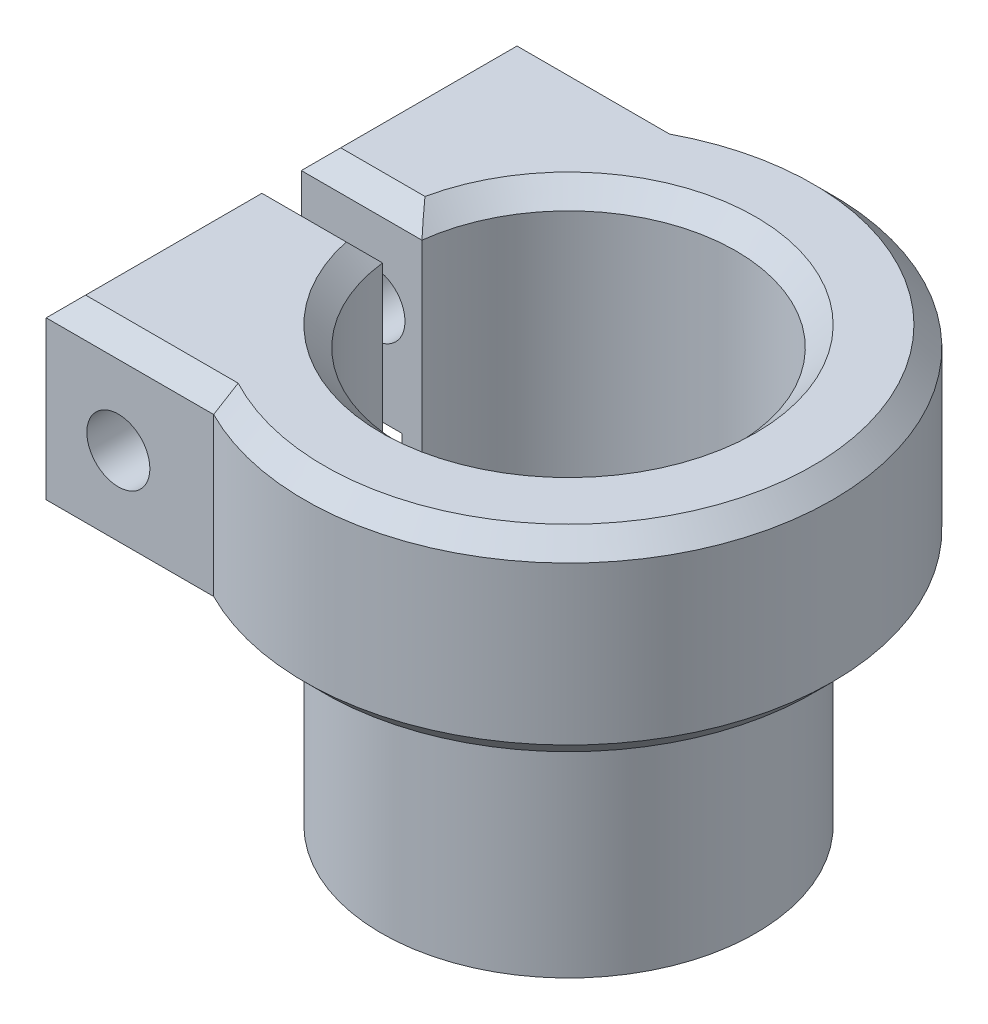
ISO-10303-21;
HEADER;
FILE_DESCRIPTION(('STEP AP214'),'2;1');
FILE_NAME('part.step','',(''),(''),'','','');
FILE_SCHEMA(('AUTOMOTIVE_DESIGN { 1 0 10303 214 1 1 1 1 }'));
ENDSEC;
DATA;
#1=APPLICATION_CONTEXT('core data for automotive mechanical design processes');
#2=APPLICATION_PROTOCOL_DEFINITION('international standard','automotive_design',2000,#1);
#3=PRODUCT_CONTEXT('',#1,'mechanical');
#4=PRODUCT('Part','Part','',(#3));
#5=PRODUCT_RELATED_PRODUCT_CATEGORY('part','',(#4));
#6=PRODUCT_DEFINITION_FORMATION('','',#4);
#7=PRODUCT_DEFINITION_CONTEXT('part definition',#1,'design');
#8=PRODUCT_DEFINITION('design','',#6,#7);
#9=PRODUCT_DEFINITION_SHAPE('','',#8);
#10=(LENGTH_UNIT() NAMED_UNIT(*) SI_UNIT(.MILLI.,.METRE.));
#11=(NAMED_UNIT(*) PLANE_ANGLE_UNIT() SI_UNIT($,.RADIAN.));
#12=(NAMED_UNIT(*) SI_UNIT($,.STERADIAN.) SOLID_ANGLE_UNIT());
#13=UNCERTAINTY_MEASURE_WITH_UNIT(LENGTH_MEASURE(1.E-05),#10,'distance_accuracy_value','');
#14=(GEOMETRIC_REPRESENTATION_CONTEXT(3) GLOBAL_UNCERTAINTY_ASSIGNED_CONTEXT((#13)) GLOBAL_UNIT_ASSIGNED_CONTEXT((#10,
#11,#12)) REPRESENTATION_CONTEXT('',''));
#15=CARTESIAN_POINT('',(0.,0.,0.));
#16=DIRECTION('',(0.,0.,1.));
#17=DIRECTION('',(1.,0.,0.));
#18=AXIS2_PLACEMENT_3D('',#15,#16,#17);
#19=CARTESIAN_POINT('',(0.,0.,0.));
#20=DIRECTION('',(0.,1.,0.));
#21=DIRECTION('',(0.,0.,1.));
#22=AXIS2_PLACEMENT_3D('',#19,#20,#21);
#23=PLANE('',#22);
#24=CARTESIAN_POINT('',(0.,0.,0.));
#25=DIRECTION('',(0.,1.,0.));
#26=DIRECTION('',(0.,0.,1.));
#27=AXIS2_PLACEMENT_3D('',#24,#25,#26);
#28=CIRCLE('',#27,9.5);
#29=CARTESIAN_POINT('',(-9.44722181384559,0.,1.));
#30=VERTEX_POINT('',#29);
#31=CARTESIAN_POINT('',(-9.44722181384559,0.,-1.));
#32=VERTEX_POINT('',#31);
#33=EDGE_CURVE('E185',#30,#32,#28,.T.);
#34=ORIENTED_EDGE('',*,*,#33,.F.);
#35=DIRECTION('',(1.,0.,0.));
#36=VECTOR('',#35,1.);
#37=CARTESIAN_POINT('',(-21.,0.,1.));
#38=LINE('',#37,#36);
#39=CARTESIAN_POINT('',(-8.44097150806707,0.,1.));
#40=VERTEX_POINT('',#39);
#41=EDGE_CURVE('E189',#30,#40,#38,.T.);
#42=ORIENTED_EDGE('',*,*,#41,.T.);
#43=CARTESIAN_POINT('',(0.,0.,0.));
#44=DIRECTION('',(0.,1.,0.));
#45=DIRECTION('',(0.,0.,1.));
#46=AXIS2_PLACEMENT_3D('',#43,#44,#45);
#47=CIRCLE('',#46,8.5);
#48=CARTESIAN_POINT('',(-8.44097150806707,0.,-1.));
#49=VERTEX_POINT('',#48);
#50=EDGE_CURVE('E187',#40,#49,#47,.T.);
#51=ORIENTED_EDGE('',*,*,#50,.T.);
#52=DIRECTION('',(1.,0.,0.));
#53=VECTOR('',#52,1.);
#54=CARTESIAN_POINT('',(-21.,0.,-1.));
#55=LINE('',#54,#53);
#56=EDGE_CURVE('E171',#32,#49,#55,.T.);
#57=ORIENTED_EDGE('',*,*,#56,.F.);
#58=EDGE_LOOP('',(#34,#42,#51,#57));
#59=FACE_BOUND('',#58,.T.);
#60=ADVANCED_FACE('F47',(#59),#23,.F.);
#61=CARTESIAN_POINT('',(0.,12.,0.));
#62=DIRECTION('',(0.,-1.,0.));
#63=DIRECTION('',(0.,0.,-1.));
#64=AXIS2_PLACEMENT_3D('',#61,#62,#63);
#65=CYLINDRICAL_SURFACE('',#64,9.5);
#66=CARTESIAN_POINT('',(0.,12.,0.));
#67=DIRECTION('',(0.,1.,0.));
#68=DIRECTION('',(0.,0.,1.));
#69=AXIS2_PLACEMENT_3D('',#66,#67,#68);
#70=CIRCLE('',#69,9.5);
#71=CARTESIAN_POINT('',(-9.44722181384559,12.,0.999999999999999));
#72=VERTEX_POINT('',#71);
#73=CARTESIAN_POINT('',(-9.44722181384559,12.,-0.999999999999999));
#74=VERTEX_POINT('',#73);
#75=EDGE_CURVE('E196',#72,#74,#70,.T.);
#76=ORIENTED_EDGE('',*,*,#75,.F.);
#77=DIRECTION('',(0.,-1.,0.));
#78=VECTOR('',#77,1.);
#79=CARTESIAN_POINT('',(-9.44722181384559,12.,0.999999999999999));
#80=LINE('',#79,#78);
#81=EDGE_CURVE('E194',#72,#30,#80,.T.);
#82=ORIENTED_EDGE('',*,*,#81,.T.);
#83=ORIENTED_EDGE('',*,*,#33,.T.);
#84=DIRECTION('',(0.,-1.,0.));
#85=VECTOR('',#84,1.);
#86=CARTESIAN_POINT('',(-9.44722181384559,12.,-0.999999999999999));
#87=LINE('',#86,#85);
#88=EDGE_CURVE('E167',#32,#74,#87,.F.);
#89=ORIENTED_EDGE('',*,*,#88,.T.);
#90=EDGE_LOOP('',(#76,#82,#83,#89));
#91=FACE_BOUND('',#90,.T.);
#92=ADVANCED_FACE('F192',(#91),#65,.T.);
#93=CARTESIAN_POINT('',(0.,12.,0.));
#94=DIRECTION('',(0.,-1.,0.));
#95=DIRECTION('',(0.,0.,-1.));
#96=AXIS2_PLACEMENT_3D('',#93,#94,#95);
#97=CYLINDRICAL_SURFACE('',#96,8.5);
#98=DIRECTION('',(0.,-1.,0.));
#99=VECTOR('',#98,1.);
#100=CARTESIAN_POINT('',(-8.44097150806707,12.,0.999999999999999));
#101=LINE('',#100,#99);
#102=CARTESIAN_POINT('',(-8.44097150806707,21.,0.999999999999999));
#103=VERTEX_POINT('',#102);
#104=EDGE_CURVE('E202',#103,#40,#101,.T.);
#105=ORIENTED_EDGE('',*,*,#104,.F.);
#106=CARTESIAN_POINT('',(0.,21.,0.));
#107=DIRECTION('',(0.,1.,0.));
#108=DIRECTION('',(0.,0.,1.));
#109=AXIS2_PLACEMENT_3D('',#106,#107,#108);
#110=CIRCLE('',#109,8.5);
#111=CARTESIAN_POINT('',(-8.44097150806707,21.,-0.999999999999999));
#112=VERTEX_POINT('',#111);
#113=EDGE_CURVE('E254',#103,#112,#110,.T.);
#114=ORIENTED_EDGE('',*,*,#113,.T.);
#115=DIRECTION('',(0.,-1.,0.));
#116=VECTOR('',#115,1.);
#117=CARTESIAN_POINT('',(-8.44097150806707,12.,-0.999999999999999));
#118=LINE('',#117,#116);
#119=EDGE_CURVE('E179',#49,#112,#118,.F.);
#120=ORIENTED_EDGE('',*,*,#119,.F.);
#121=ORIENTED_EDGE('',*,*,#50,.F.);
#122=EDGE_LOOP('',(#105,#114,#120,#121));
#123=FACE_BOUND('',#122,.T.);
#124=ADVANCED_FACE('F431',(#123),#97,.F.);
#125=CARTESIAN_POINT('',(0.,22.,0.));
#126=DIRECTION('',(0.,1.,0.));
#127=DIRECTION('',(0.,0.,1.));
#128=AXIS2_PLACEMENT_3D('',#125,#126,#127);
#129=PLANE('',#128);
#130=DIRECTION('',(0.,0.,1.));
#131=VECTOR('',#130,1.);
#132=CARTESIAN_POINT('',(-13.5637208057857,22.,0.));
#133=LINE('',#132,#131);
#134=CARTESIAN_POINT('',(-13.5637208057857,22.,2.));
#135=VERTEX_POINT('',#134);
#136=CARTESIAN_POINT('',(-13.5637208057857,22.,10.9495309526978));
#137=VERTEX_POINT('',#136);
#138=EDGE_CURVE('E228',#135,#137,#133,.T.);
#139=ORIENTED_EDGE('',*,*,#138,.T.);
#140=DIRECTION('',(1.,0.,0.));
#141=VECTOR('',#140,1.);
#142=CARTESIAN_POINT('',(0.,22.,10.9495309526978));
#143=LINE('',#142,#141);
#144=CARTESIAN_POINT('',(-5.81960238469219,22.,10.9495309526977));
#145=VERTEX_POINT('',#144);
#146=EDGE_CURVE('E231',#137,#145,#143,.T.);
#147=ORIENTED_EDGE('',*,*,#146,.T.);
#148=CARTESIAN_POINT('',(0.,22.,0.));
#149=DIRECTION('',(0.,1.,0.));
#150=DIRECTION('',(0.,0.,1.));
#151=AXIS2_PLACEMENT_3D('',#148,#149,#150);
#152=CIRCLE('',#151,12.4);
#153=CARTESIAN_POINT('',(-5.81960238469219,22.,-10.9495309526977));
#154=VERTEX_POINT('',#153);
#155=EDGE_CURVE('E200',#145,#154,#152,.T.);
#156=ORIENTED_EDGE('',*,*,#155,.T.);
#157=DIRECTION('',(-1.,0.,0.));
#158=VECTOR('',#157,1.);
#159=CARTESIAN_POINT('',(0.,22.,-10.9495309526978));
#160=LINE('',#159,#158);
#161=CARTESIAN_POINT('',(-13.5637208057857,22.,-10.9495309526978));
#162=VERTEX_POINT('',#161);
#163=EDGE_CURVE('E213',#154,#162,#160,.T.);
#164=ORIENTED_EDGE('',*,*,#163,.T.);
#165=DIRECTION('',(0.,0.,1.));
#166=VECTOR('',#165,1.);
#167=CARTESIAN_POINT('',(-13.5637208057857,22.,0.));
#168=LINE('',#167,#166);
#169=CARTESIAN_POINT('',(-13.5637208057857,22.,-2.));
#170=VERTEX_POINT('',#169);
#171=EDGE_CURVE('E216',#162,#170,#168,.T.);
#172=ORIENTED_EDGE('',*,*,#171,.T.);
#173=DIRECTION('',(1.,0.,0.));
#174=VECTOR('',#173,1.);
#175=CARTESIAN_POINT('',(-8.44097150806707,22.,-2.));
#176=LINE('',#175,#174);
#177=CARTESIAN_POINT('',(-9.28708781050336,22.,-2.));
#178=VERTEX_POINT('',#177);
#179=EDGE_CURVE('E219',#170,#178,#176,.T.);
#180=ORIENTED_EDGE('',*,*,#179,.T.);
#181=CARTESIAN_POINT('',(0.,22.,0.));
#182=DIRECTION('',(0.,1.,0.));
#183=DIRECTION('',(0.,0.,1.));
#184=AXIS2_PLACEMENT_3D('',#181,#182,#183);
#185=CIRCLE('',#184,9.50000000000001);
#186=CARTESIAN_POINT('',(-9.28708781050336,22.,1.99999999999999));
#187=VERTEX_POINT('',#186);
#188=EDGE_CURVE('E222',#178,#187,#185,.F.);
#189=ORIENTED_EDGE('',*,*,#188,.T.);
#190=DIRECTION('',(-1.,0.,0.));
#191=VECTOR('',#190,1.);
#192=CARTESIAN_POINT('',(-14.5637208057857,22.,2.));
#193=LINE('',#192,#191);
#194=EDGE_CURVE('E225',#187,#135,#193,.T.);
#195=ORIENTED_EDGE('',*,*,#194,.T.);
#196=EDGE_LOOP('',(#139,#147,#156,#164,#172,#180,#189,#195));
#197=FACE_BOUND('',#196,.T.);
#198=ADVANCED_FACE('F435',(#197),#129,.T.);
#199=CARTESIAN_POINT('',(0.,12.,0.));
#200=DIRECTION('',(0.,1.,0.));
#201=DIRECTION('',(0.,0.,1.));
#202=AXIS2_PLACEMENT_3D('',#199,#200,#201);
#203=PLANE('',#202);
#204=DIRECTION('',(-1.,0.,0.));
#205=VECTOR('',#204,1.);
#206=CARTESIAN_POINT('',(0.,12.,-0.999999999999999));
#207=LINE('',#206,#205);
#208=CARTESIAN_POINT('',(-13.5637208057857,12.,-0.999999999999999));
#209=VERTEX_POINT('',#208);
#210=EDGE_CURVE('E174',#74,#209,#207,.T.);
#211=ORIENTED_EDGE('',*,*,#210,.T.);
#212=DIRECTION('',(0.,0.,-1.));
#213=VECTOR('',#212,1.);
#214=CARTESIAN_POINT('',(-13.5637208057857,12.,-11.9495309526978));
#215=LINE('',#214,#213);
#216=CARTESIAN_POINT('',(-13.5637208057857,12.,-10.9495309526978));
#217=VERTEX_POINT('',#216);
#218=EDGE_CURVE('E11',#209,#217,#215,.T.);
#219=ORIENTED_EDGE('',*,*,#218,.T.);
#220=DIRECTION('',(1.,0.,0.));
#221=VECTOR('',#220,1.);
#222=CARTESIAN_POINT('',(-6.06372080578567,12.,-10.9495309526978));
#223=LINE('',#222,#221);
#224=CARTESIAN_POINT('',(-5.8196023846922,12.,-10.9495309526978));
#225=VERTEX_POINT('',#224);
#226=EDGE_CURVE('E282',#217,#225,#223,.T.);
#227=ORIENTED_EDGE('',*,*,#226,.T.);
#228=CARTESIAN_POINT('',(0.,12.,0.));
#229=DIRECTION('',(0.,1.,0.));
#230=DIRECTION('',(0.,0.,1.));
#231=AXIS2_PLACEMENT_3D('',#228,#229,#230);
#232=CIRCLE('',#231,12.4);
#233=CARTESIAN_POINT('',(-5.8196023846922,12.,10.9495309526977));
#234=VERTEX_POINT('',#233);
#235=EDGE_CURVE('E71',#225,#234,#232,.F.);
#236=ORIENTED_EDGE('',*,*,#235,.T.);
#237=DIRECTION('',(-1.,0.,0.));
#238=VECTOR('',#237,1.);
#239=CARTESIAN_POINT('',(-14.5637208057857,12.,10.9495309526978));
#240=LINE('',#239,#238);
#241=CARTESIAN_POINT('',(-13.5637208057857,12.,10.9495309526978));
#242=VERTEX_POINT('',#241);
#243=EDGE_CURVE('E66',#234,#242,#240,.T.);
#244=ORIENTED_EDGE('',*,*,#243,.T.);
#245=DIRECTION('',(0.,0.,-1.));
#246=VECTOR('',#245,1.);
#247=CARTESIAN_POINT('',(-13.5637208057857,12.,0.999999999999997));
#248=LINE('',#247,#246);
#249=CARTESIAN_POINT('',(-13.5637208057857,12.,0.999999999999999));
#250=VERTEX_POINT('',#249);
#251=EDGE_CURVE('E58',#242,#250,#248,.T.);
#252=ORIENTED_EDGE('',*,*,#251,.T.);
#253=DIRECTION('',(1.,0.,0.));
#254=VECTOR('',#253,1.);
#255=CARTESIAN_POINT('',(0.,12.,0.999999999999999));
#256=LINE('',#255,#254);
#257=EDGE_CURVE('E520',#250,#72,#256,.T.);
#258=ORIENTED_EDGE('',*,*,#257,.T.);
#259=ORIENTED_EDGE('',*,*,#75,.T.);
#260=EDGE_LOOP('',(#211,#219,#227,#236,#244,#252,#258,#259));
#261=FACE_BOUND('',#260,.T.);
#262=ADVANCED_FACE('F440',(#261),#203,.F.);
#263=CARTESIAN_POINT('',(0.,22.,0.));
#264=DIRECTION('',(0.,-1.,0.));
#265=DIRECTION('',(0.,0.,-1.));
#266=AXIS2_PLACEMENT_3D('',#263,#264,#265);
#267=CYLINDRICAL_SURFACE('',#266,13.4);
#268=DIRECTION('',(0.,1.,0.));
#269=VECTOR('',#268,1.);
#270=CARTESIAN_POINT('',(-6.06372080578567,12.,-11.9495309526978));
#271=LINE('',#270,#269);
#272=CARTESIAN_POINT('',(-6.06372080578567,13.,-11.9495309526978));
#273=VERTEX_POINT('',#272);
#274=CARTESIAN_POINT('',(-6.06372080578567,21.,-11.9495309526978));
#275=VERTEX_POINT('',#274);
#276=EDGE_CURVE('E495',#273,#275,#271,.T.);
#277=ORIENTED_EDGE('',*,*,#276,.T.);
#278=CARTESIAN_POINT('',(0.,21.,0.));
#279=DIRECTION('',(0.,1.,0.));
#280=DIRECTION('',(0.,0.,1.));
#281=AXIS2_PLACEMENT_3D('',#278,#279,#280);
#282=CIRCLE('',#281,13.4);
#283=CARTESIAN_POINT('',(-6.06372080578567,21.,11.9495309526978));
#284=VERTEX_POINT('',#283);
#285=EDGE_CURVE('E279',#275,#284,#282,.F.);
#286=ORIENTED_EDGE('',*,*,#285,.T.);
#287=DIRECTION('',(0.,1.,0.));
#288=VECTOR('',#287,1.);
#289=CARTESIAN_POINT('',(-6.06372080578567,12.,11.9495309526978));
#290=LINE('',#289,#288);
#291=CARTESIAN_POINT('',(-6.06372080578567,13.,11.9495309526978));
#292=VERTEX_POINT('',#291);
#293=EDGE_CURVE('E503',#292,#284,#290,.T.);
#294=ORIENTED_EDGE('',*,*,#293,.F.);
#295=CARTESIAN_POINT('',(0.,13.,0.));
#296=DIRECTION('',(0.,1.,0.));
#297=DIRECTION('',(0.,0.,1.));
#298=AXIS2_PLACEMENT_3D('',#295,#296,#297);
#299=CIRCLE('',#298,13.4);
#300=EDGE_CURVE('E276',#292,#273,#299,.T.);
#301=ORIENTED_EDGE('',*,*,#300,.T.);
#302=EDGE_LOOP('',(#277,#286,#294,#301));
#303=FACE_BOUND('',#302,.T.);
#304=ADVANCED_FACE('F437',(#303),#267,.T.);
#305=CARTESIAN_POINT('',(-21.,22.,-0.999999999999997));
#306=DIRECTION('',(0.,0.,-1.));
#307=DIRECTION('',(0.,1.,0.));
#308=AXIS2_PLACEMENT_3D('',#305,#306,#307);
#309=PLANE('',#308);
#310=CARTESIAN_POINT('',(-10.9018029894296,17.,-0.999999999999997));
#311=DIRECTION('',(0.,0.,-1.));
#312=DIRECTION('',(0.,1.,0.));
#313=AXIS2_PLACEMENT_3D('',#310,#311,#312);
#314=CIRCLE('',#313,1.6);
#315=CARTESIAN_POINT('',(-10.9018029894296,18.6,-0.999999999999997));
#316=VERTEX_POINT('',#315);
#317=EDGE_CURVE('E481',#316,#316,#314,.F.);
#318=ORIENTED_EDGE('',*,*,#317,.F.);
#319=EDGE_LOOP('',(#318));
#320=FACE_BOUND('',#319,.T.);
#321=ORIENTED_EDGE('',*,*,#119,.T.);
#322=DIRECTION('',(-1.,0.,0.));
#323=VECTOR('',#322,1.);
#324=CARTESIAN_POINT('',(-14.5637208057857,21.,-0.999999999999998));
#325=LINE('',#324,#323);
#326=CARTESIAN_POINT('',(-14.5637208057857,21.,-0.999999999999997));
#327=VERTEX_POINT('',#326);
#328=EDGE_CURVE('E260',#112,#327,#325,.T.);
#329=ORIENTED_EDGE('',*,*,#328,.T.);
#330=DIRECTION('',(0.,1.,0.));
#331=VECTOR('',#330,1.);
#332=CARTESIAN_POINT('',(-14.5637208057857,12.,-0.999999999999997));
#333=LINE('',#332,#331);
#334=CARTESIAN_POINT('',(-14.5637208057857,13.,-0.999999999999997));
#335=VERTEX_POINT('',#334);
#336=EDGE_CURVE('E483',#335,#327,#333,.T.);
#337=ORIENTED_EDGE('',*,*,#336,.F.);
#338=DIRECTION('',(0.707106781186548,-0.707106781186548,0.));
#339=VECTOR('',#338,1.);
#340=CARTESIAN_POINT('',(-14.5637208057857,13.,-0.999999999999999));
#341=LINE('',#340,#339);
#342=EDGE_CURVE('E257',#335,#209,#341,.T.);
#343=ORIENTED_EDGE('',*,*,#342,.T.);
#344=ORIENTED_EDGE('',*,*,#210,.F.);
#345=ORIENTED_EDGE('',*,*,#88,.F.);
#346=ORIENTED_EDGE('',*,*,#56,.T.);
#347=EDGE_LOOP('',(#321,#329,#337,#343,#344,#345,#346));
#348=FACE_BOUND('',#347,.T.);
#349=ADVANCED_FACE('F170',(#320,#348),#309,.F.);
#350=CARTESIAN_POINT('',(-21.,22.,0.999999999999997));
#351=DIRECTION('',(0.,0.,1.));
#352=DIRECTION('',(0.,-1.,0.));
#353=AXIS2_PLACEMENT_3D('',#350,#351,#352);
#354=PLANE('',#353);
#355=CARTESIAN_POINT('',(-10.9018029894296,17.,0.999999999999997));
#356=DIRECTION('',(0.,0.,1.));
#357=DIRECTION('',(0.,-1.,0.));
#358=AXIS2_PLACEMENT_3D('',#355,#356,#357);
#359=CIRCLE('',#358,1.6);
#360=CARTESIAN_POINT('',(-10.9018029894296,15.4,0.999999999999998));
#361=VERTEX_POINT('',#360);
#362=EDGE_CURVE('E484',#361,#361,#359,.F.);
#363=ORIENTED_EDGE('',*,*,#362,.F.);
#364=EDGE_LOOP('',(#363));
#365=FACE_BOUND('',#364,.T.);
#366=DIRECTION('',(0.,1.,0.));
#367=VECTOR('',#366,1.);
#368=CARTESIAN_POINT('',(-14.5637208057857,12.,0.999999999999997));
#369=LINE('',#368,#367);
#370=CARTESIAN_POINT('',(-14.5637208057857,13.,0.999999999999997));
#371=VERTEX_POINT('',#370);
#372=CARTESIAN_POINT('',(-14.5637208057857,21.,0.999999999999997));
#373=VERTEX_POINT('',#372);
#374=EDGE_CURVE('E499',#371,#373,#369,.T.);
#375=ORIENTED_EDGE('',*,*,#374,.T.);
#376=DIRECTION('',(1.,0.,0.));
#377=VECTOR('',#376,1.);
#378=CARTESIAN_POINT('',(-8.44097150806707,21.,0.999999999999998));
#379=LINE('',#378,#377);
#380=EDGE_CURVE('E251',#373,#103,#379,.T.);
#381=ORIENTED_EDGE('',*,*,#380,.T.);
#382=ORIENTED_EDGE('',*,*,#104,.T.);
#383=ORIENTED_EDGE('',*,*,#41,.F.);
#384=ORIENTED_EDGE('',*,*,#81,.F.);
#385=ORIENTED_EDGE('',*,*,#257,.F.);
#386=DIRECTION('',(-0.707106781186548,0.707106781186548,0.));
#387=VECTOR('',#386,1.);
#388=CARTESIAN_POINT('',(-14.5637208057857,13.,0.999999999999999));
#389=LINE('',#388,#387);
#390=EDGE_CURVE('E248',#250,#371,#389,.T.);
#391=ORIENTED_EDGE('',*,*,#390,.T.);
#392=EDGE_LOOP('',(#375,#381,#382,#383,#384,#385,#391));
#393=FACE_BOUND('',#392,.T.);
#394=ADVANCED_FACE('F447',(#365,#393),#354,.F.);
#395=CARTESIAN_POINT('',(-6.06372080578567,12.,11.9495309526978));
#396=DIRECTION('',(0.,0.,1.));
#397=DIRECTION('',(1.,0.,0.));
#398=AXIS2_PLACEMENT_3D('',#395,#396,#397);
#399=PLANE('',#398);
#400=CARTESIAN_POINT('',(-10.9018029894296,17.,11.9495309526978));
#401=DIRECTION('',(0.,0.,1.));
#402=DIRECTION('',(1.,0.,0.));
#403=AXIS2_PLACEMENT_3D('',#400,#401,#402);
#404=CIRCLE('',#403,1.6);
#405=CARTESIAN_POINT('',(-9.30180298942956,17.,11.9495309526978));
#406=VERTEX_POINT('',#405);
#407=EDGE_CURVE('E209',#406,#406,#404,.F.);
#408=ORIENTED_EDGE('',*,*,#407,.T.);
#409=EDGE_LOOP('',(#408));
#410=FACE_BOUND('',#409,.T.);
#411=ORIENTED_EDGE('',*,*,#293,.T.);
#412=DIRECTION('',(-1.,0.,0.));
#413=VECTOR('',#412,1.);
#414=CARTESIAN_POINT('',(-6.06372080578567,21.,11.9495309526978));
#415=LINE('',#414,#413);
#416=CARTESIAN_POINT('',(-14.5637208057857,21.,11.9495309526978));
#417=VERTEX_POINT('',#416);
#418=EDGE_CURVE('E238',#284,#417,#415,.T.);
#419=ORIENTED_EDGE('',*,*,#418,.T.);
#420=DIRECTION('',(0.,1.,0.));
#421=VECTOR('',#420,1.);
#422=CARTESIAN_POINT('',(-14.5637208057857,12.,11.9495309526978));
#423=LINE('',#422,#421);
#424=CARTESIAN_POINT('',(-14.5637208057857,13.,11.9495309526978));
#425=VERTEX_POINT('',#424);
#426=EDGE_CURVE('E507',#425,#417,#423,.T.);
#427=ORIENTED_EDGE('',*,*,#426,.F.);
#428=DIRECTION('',(1.,0.,0.));
#429=VECTOR('',#428,1.);
#430=CARTESIAN_POINT('',(-6.06372080578567,13.,11.9495309526978));
#431=LINE('',#430,#429);
#432=EDGE_CURVE('E235',#425,#292,#431,.T.);
#433=ORIENTED_EDGE('',*,*,#432,.T.);
#434=EDGE_LOOP('',(#411,#419,#427,#433));
#435=FACE_BOUND('',#434,.T.);
#436=ADVANCED_FACE('F450',(#410,#435),#399,.T.);
#437=CARTESIAN_POINT('',(-14.5637208057857,12.,0.999999999999997));
#438=DIRECTION('',(-1.,0.,0.));
#439=DIRECTION('',(0.,0.,1.));
#440=AXIS2_PLACEMENT_3D('',#437,#438,#439);
#441=PLANE('',#440);
#442=ORIENTED_EDGE('',*,*,#426,.T.);
#443=DIRECTION('',(0.,0.,-1.));
#444=VECTOR('',#443,1.);
#445=CARTESIAN_POINT('',(-14.5637208057857,21.,0.999999999999997));
#446=LINE('',#445,#444);
#447=EDGE_CURVE('E245',#417,#373,#446,.T.);
#448=ORIENTED_EDGE('',*,*,#447,.T.);
#449=ORIENTED_EDGE('',*,*,#374,.F.);
#450=DIRECTION('',(0.,0.,1.));
#451=VECTOR('',#450,1.);
#452=CARTESIAN_POINT('',(-14.5637208057857,13.,11.9495309526978));
#453=LINE('',#452,#451);
#454=EDGE_CURVE('E242',#371,#425,#453,.T.);
#455=ORIENTED_EDGE('',*,*,#454,.T.);
#456=EDGE_LOOP('',(#442,#448,#449,#455));
#457=FACE_BOUND('',#456,.T.);
#458=ADVANCED_FACE('F455',(#457),#441,.T.);
#459=CARTESIAN_POINT('',(-14.5637208057857,12.,-0.999999999999997));
#460=DIRECTION('',(-1.,0.,0.));
#461=DIRECTION('',(0.,0.,1.));
#462=AXIS2_PLACEMENT_3D('',#459,#460,#461);
#463=PLANE('',#462);
#464=ORIENTED_EDGE('',*,*,#336,.T.);
#465=DIRECTION('',(0.,0.,-1.));
#466=VECTOR('',#465,1.);
#467=CARTESIAN_POINT('',(-14.5637208057857,21.,-0.999999999999997));
#468=LINE('',#467,#466);
#469=CARTESIAN_POINT('',(-14.5637208057857,21.,-11.9495309526978));
#470=VERTEX_POINT('',#469);
#471=EDGE_CURVE('E267',#327,#470,#468,.T.);
#472=ORIENTED_EDGE('',*,*,#471,.T.);
#473=DIRECTION('',(0.,1.,0.));
#474=VECTOR('',#473,1.);
#475=CARTESIAN_POINT('',(-14.5637208057857,12.,-11.9495309526978));
#476=LINE('',#475,#474);
#477=CARTESIAN_POINT('',(-14.5637208057857,13.,-11.9495309526978));
#478=VERTEX_POINT('',#477);
#479=EDGE_CURVE('E489',#478,#470,#476,.T.);
#480=ORIENTED_EDGE('',*,*,#479,.F.);
#481=DIRECTION('',(0.,0.,1.));
#482=VECTOR('',#481,1.);
#483=CARTESIAN_POINT('',(-14.5637208057857,13.,-0.999999999999997));
#484=LINE('',#483,#482);
#485=EDGE_CURVE('E263',#478,#335,#484,.T.);
#486=ORIENTED_EDGE('',*,*,#485,.T.);
#487=EDGE_LOOP('',(#464,#472,#480,#486));
#488=FACE_BOUND('',#487,.T.);
#489=ADVANCED_FACE('F458',(#488),#463,.T.);
#490=CARTESIAN_POINT('',(-6.06372080578567,12.,-11.9495309526978));
#491=DIRECTION('',(0.,0.,-1.));
#492=DIRECTION('',(-1.,0.,0.));
#493=AXIS2_PLACEMENT_3D('',#490,#491,#492);
#494=PLANE('',#493);
#495=CARTESIAN_POINT('',(-10.9018029894296,17.,-11.9495309526978));
#496=DIRECTION('',(0.,0.,-1.));
#497=DIRECTION('',(-1.,0.,0.));
#498=AXIS2_PLACEMENT_3D('',#495,#496,#497);
#499=CIRCLE('',#498,1.6);
#500=CARTESIAN_POINT('',(-12.5018029894296,17.,-11.9495309526978));
#501=VERTEX_POINT('',#500);
#502=EDGE_CURVE('E205',#501,#501,#499,.F.);
#503=ORIENTED_EDGE('',*,*,#502,.T.);
#504=EDGE_LOOP('',(#503));
#505=FACE_BOUND('',#504,.T.);
#506=ORIENTED_EDGE('',*,*,#479,.T.);
#507=DIRECTION('',(1.,0.,0.));
#508=VECTOR('',#507,1.);
#509=CARTESIAN_POINT('',(-6.06372080578567,21.,-11.9495309526978));
#510=LINE('',#509,#508);
#511=EDGE_CURVE('E273',#470,#275,#510,.T.);
#512=ORIENTED_EDGE('',*,*,#511,.T.);
#513=ORIENTED_EDGE('',*,*,#276,.F.);
#514=DIRECTION('',(-1.,0.,0.));
#515=VECTOR('',#514,1.);
#516=CARTESIAN_POINT('',(-14.5637208057857,13.,-11.9495309526978));
#517=LINE('',#516,#515);
#518=EDGE_CURVE('E270',#273,#478,#517,.T.);
#519=ORIENTED_EDGE('',*,*,#518,.T.);
#520=EDGE_LOOP('',(#506,#512,#513,#519));
#521=FACE_BOUND('',#520,.T.);
#522=ADVANCED_FACE('F465',(#505,#521),#494,.T.);
#523=CARTESIAN_POINT('',(-10.9018029894296,17.,20.));
#524=DIRECTION('',(0.,0.,-1.));
#525=DIRECTION('',(-1.,0.,0.));
#526=AXIS2_PLACEMENT_3D('',#523,#524,#525);
#527=CYLINDRICAL_SURFACE('',#526,1.6);
#528=ORIENTED_EDGE('',*,*,#502,.F.);
#529=EDGE_LOOP('',(#528));
#530=FACE_BOUND('',#529,.T.);
#531=ORIENTED_EDGE('',*,*,#317,.T.);
#532=EDGE_LOOP('',(#531));
#533=FACE_BOUND('',#532,.T.);
#534=ADVANCED_FACE('F469',(#530,#533),#527,.F.);
#535=ORIENTED_EDGE('',*,*,#407,.F.);
#536=EDGE_LOOP('',(#535));
#537=FACE_BOUND('',#536,.T.);
#538=ORIENTED_EDGE('',*,*,#362,.T.);
#539=EDGE_LOOP('',(#538));
#540=FACE_BOUND('',#539,.T.);
#541=ADVANCED_FACE('F373',(#537,#540),#527,.F.);
#542=CARTESIAN_POINT('',(0.,22.,-2.));
#543=DIRECTION('',(0.,0.707106781186546,0.707106781186549));
#544=DIRECTION('',(-1.,0.,0.));
#545=AXIS2_PLACEMENT_3D('',#542,#543,#544);
#546=PLANE('',#545);
#547=DIRECTION('',(-0.577350269189625,-0.577350269189628,0.577350269189625));
#548=VECTOR('',#547,1.);
#549=CARTESIAN_POINT('',(-14.2303874724523,21.3333333333333,-1.33333333333334));
#550=LINE('',#549,#548);
#551=EDGE_CURVE('E346',#327,#170,#550,.F.);
#552=ORIENTED_EDGE('',*,*,#551,.F.);
#553=ORIENTED_EDGE('',*,*,#328,.F.);
#554=CARTESIAN_POINT('',(-8.44097150806707,21.,-0.999999999999999));
#555=CARTESIAN_POINT('',(-8.51404163041319,21.0822392306684,-1.08223923066841));
#556=CARTESIAN_POINT('',(-8.58643289709971,21.1647792437353,-1.1647792437353));
#557=CARTESIAN_POINT('',(-8.72991025995207,21.3304121003003,-1.33041210030034));
#558=CARTESIAN_POINT('',(-8.80099649947292,21.4135048816951,-1.41350488169511));
#559=CARTESIAN_POINT('',(-8.94193140168498,21.580211468494,-1.58021146849397));
#560=CARTESIAN_POINT('',(-9.0117800831664,21.6638252659612,-1.66382526596122));
#561=CARTESIAN_POINT('',(-9.1503031470732,21.8315503090382,-1.83155030903821));
#562=CARTESIAN_POINT('',(-9.21897739887286,21.9156616086002,-1.91566160860017));
#563=CARTESIAN_POINT('',(-9.28708781050336,22.,-2.));
#564=B_SPLINE_CURVE_WITH_KNOTS('',3,(#554,#555,#556,#557,#558,#559,#560,#561,#562,#563),
.UNSPECIFIED.,.F.,.F.,(4,2,2,2,4),(0.,0.412055043364054,0.824064549019336,1.23606779363739,
1.64811656904959),.UNSPECIFIED.);
#565=EDGE_CURVE('E210',#178,#112,#564,.F.);
#566=ORIENTED_EDGE('',*,*,#565,.F.);
#567=ORIENTED_EDGE('',*,*,#179,.F.);
#568=EDGE_LOOP('',(#552,#553,#566,#567));
#569=FACE_BOUND('',#568,.T.);
#570=ADVANCED_FACE('F367',(#569),#546,.T.);
#571=CARTESIAN_POINT('',(0.,21.,0.));
#572=DIRECTION('',(0.,1.,0.));
#573=DIRECTION('',(0.,0.,1.));
#574=AXIS2_PLACEMENT_3D('',#571,#572,#573);
#575=CONICAL_SURFACE('',#574,8.5,0.785398163397446);
#576=ORIENTED_EDGE('',*,*,#565,.T.);
#577=ORIENTED_EDGE('',*,*,#113,.F.);
#578=CARTESIAN_POINT('',(-8.44097150806707,21.,0.999999999999999));
#579=CARTESIAN_POINT('',(-8.51404163041319,21.0822392306684,1.08223923066841));
#580=CARTESIAN_POINT('',(-8.58643289709972,21.1647792437353,1.1647792437353));
#581=CARTESIAN_POINT('',(-8.72991025995207,21.3304121003003,1.33041210030035));
#582=CARTESIAN_POINT('',(-8.80099649947293,21.4135048816951,1.41350488169512));
#583=CARTESIAN_POINT('',(-8.94193140168499,21.580211468494,1.58021146849398));
#584=CARTESIAN_POINT('',(-9.01178008316641,21.6638252659612,1.66382526596123));
#585=CARTESIAN_POINT('',(-9.15030314707322,21.8315503090382,1.83155030903822));
#586=CARTESIAN_POINT('',(-9.21897739887287,21.9156616086002,1.91566160860019));
#587=CARTESIAN_POINT('',(-9.28708781050337,22.,2.00000000000002));
#588=B_SPLINE_CURVE_WITH_KNOTS('',3,(#578,#579,#580,#581,#582,#583,#584,#585,#586,#587),
.UNSPECIFIED.,.F.,.F.,(4,2,2,2,4),(0.,0.412055043364061,0.824064549019348,1.23606779363741,
1.64811656904962),.UNSPECIFIED.);
#589=EDGE_CURVE('E336',#187,#103,#588,.F.);
#590=ORIENTED_EDGE('',*,*,#589,.F.);
#591=ORIENTED_EDGE('',*,*,#188,.F.);
#592=EDGE_LOOP('',(#576,#577,#590,#591));
#593=FACE_BOUND('',#592,.T.);
#594=ADVANCED_FACE('F349',(#593),#575,.F.);
#595=CARTESIAN_POINT('',(-13.5637208057857,22.,0.));
#596=DIRECTION('',(0.707106781186549,-0.707106781186546,0.));
#597=DIRECTION('',(0.,0.,1.));
#598=AXIS2_PLACEMENT_3D('',#595,#596,#597);
#599=PLANE('',#598);
#600=ORIENTED_EDGE('',*,*,#551,.T.);
#601=ORIENTED_EDGE('',*,*,#171,.F.);
#602=DIRECTION('',(0.577350269189625,0.577350269189628,0.577350269189624));
#603=VECTOR('',#602,1.);
#604=CARTESIAN_POINT('',(-9.04248053719045,26.5212402685952,-6.42829068410256));
#605=LINE('',#604,#603);
#606=EDGE_CURVE('E332',#470,#162,#605,.T.);
#607=ORIENTED_EDGE('',*,*,#606,.F.);
#608=ORIENTED_EDGE('',*,*,#471,.F.);
#609=EDGE_LOOP('',(#600,#601,#607,#608));
#610=FACE_BOUND('',#609,.T.);
#611=ADVANCED_FACE('F359',(#610),#599,.F.);
#612=CARTESIAN_POINT('',(-21.,21.,0.999999999999998));
#613=DIRECTION('',(0.,0.707106781186546,-0.707106781186549));
#614=DIRECTION('',(-1.,0.,0.));
#615=AXIS2_PLACEMENT_3D('',#612,#613,#614);
#616=PLANE('',#615);
#617=ORIENTED_EDGE('',*,*,#589,.T.);
#618=ORIENTED_EDGE('',*,*,#380,.F.);
#619=DIRECTION('',(-0.577350269189625,-0.577350269189628,-0.577350269189625));
#620=VECTOR('',#619,1.);
#621=CARTESIAN_POINT('',(-16.7091472038571,18.8545736019285,-1.14542639807144));
#622=LINE('',#621,#620);
#623=EDGE_CURVE('E328',#135,#373,#622,.T.);
#624=ORIENTED_EDGE('',*,*,#623,.F.);
#625=ORIENTED_EDGE('',*,*,#194,.F.);
#626=EDGE_LOOP('',(#617,#618,#624,#625));
#627=FACE_BOUND('',#626,.T.);
#628=ADVANCED_FACE('F352',(#627),#616,.T.);
#629=CARTESIAN_POINT('',(0.,22.,-10.9495309526978));
#630=DIRECTION('',(0.,-0.707106781186545,0.70710678118655));
#631=DIRECTION('',(-1.,0.,0.));
#632=AXIS2_PLACEMENT_3D('',#629,#630,#631);
#633=PLANE('',#632);
#634=ORIENTED_EDGE('',*,*,#606,.T.);
#635=ORIENTED_EDGE('',*,*,#163,.F.);
#636=CARTESIAN_POINT('',(-6.06372080578567,21.,-11.9495309526978));
#637=CARTESIAN_POINT('',(-6.02384596036799,21.1667657050875,-11.7827652476103));
#638=CARTESIAN_POINT('',(-5.98356533828534,21.3334818813956,-11.6160490713021));
#639=CARTESIAN_POINT('',(-5.90219253144069,21.6668152147517,-11.282715737946));
#640=CARTESIAN_POINT('',(-5.86110034649222,21.8334323717769,-11.1160985809209));
#641=CARTESIAN_POINT('',(-5.81960238469227,22.,-10.9495309526978));
#642=B_SPLINE_CURVE_WITH_KNOTS('',3,(#636,#637,#638,#639,#640,#641),.UNSPECIFIED.,.F.,.F.,(4,2,
4),(0.,0.717565229514986,1.43513062391981),.UNSPECIFIED.);
#643=EDGE_CURVE('E320',#275,#154,#642,.T.);
#644=ORIENTED_EDGE('',*,*,#643,.F.);
#645=ORIENTED_EDGE('',*,*,#511,.F.);
#646=EDGE_LOOP('',(#634,#635,#644,#645));
#647=FACE_BOUND('',#646,.T.);
#648=ADVANCED_FACE('F316',(#647),#633,.F.);
#649=CARTESIAN_POINT('',(-13.5637208057857,22.,0.));
#650=DIRECTION('',(0.707106781186549,-0.707106781186546,0.));
#651=DIRECTION('',(0.,0.,1.));
#652=AXIS2_PLACEMENT_3D('',#649,#650,#651);
#653=PLANE('',#652);
#654=ORIENTED_EDGE('',*,*,#623,.T.);
#655=ORIENTED_EDGE('',*,*,#447,.F.);
#656=DIRECTION('',(0.577350269189625,0.577350269189628,-0.577350269189624));
#657=VECTOR('',#656,1.);
#658=CARTESIAN_POINT('',(-9.91387715488642,25.6498436508993,7.29968730179853));
#659=LINE('',#658,#657);
#660=EDGE_CURVE('E300',#137,#417,#659,.F.);
#661=ORIENTED_EDGE('',*,*,#660,.F.);
#662=ORIENTED_EDGE('',*,*,#138,.F.);
#663=EDGE_LOOP('',(#654,#655,#661,#662));
#664=FACE_BOUND('',#663,.T.);
#665=ADVANCED_FACE('F314',(#664),#653,.F.);
#666=CARTESIAN_POINT('',(0.,22.,0.));
#667=DIRECTION('',(0.,-1.,0.));
#668=DIRECTION('',(0.,0.,-1.));
#669=AXIS2_PLACEMENT_3D('',#666,#667,#668);
#670=CONICAL_SURFACE('',#669,12.4,0.785398163397446);
#671=ORIENTED_EDGE('',*,*,#643,.T.);
#672=ORIENTED_EDGE('',*,*,#155,.F.);
#673=CARTESIAN_POINT('',(-5.81960238469223,22.,10.9495309526978));
#674=CARTESIAN_POINT('',(-5.86110034649216,21.8334323717769,11.1160985809209));
#675=CARTESIAN_POINT('',(-5.90219253144065,21.6668152147517,11.282715737946));
#676=CARTESIAN_POINT('',(-5.98356533828538,21.3334818813956,11.6160490713021));
#677=CARTESIAN_POINT('',(-6.02384596036811,21.1667657050875,11.7827652476103));
#678=CARTESIAN_POINT('',(-6.0637208057859,21.,11.9495309526977));
#679=B_SPLINE_CURVE_WITH_KNOTS('',3,(#673,#674,#675,#676,#677,#678),.UNSPECIFIED.,.F.,.F.,(4,2,
4),(0.,0.71756539440482,1.4351306239198),.UNSPECIFIED.);
#680=EDGE_CURVE('E291',#284,#145,#679,.F.);
#681=ORIENTED_EDGE('',*,*,#680,.F.);
#682=ORIENTED_EDGE('',*,*,#285,.F.);
#683=EDGE_LOOP('',(#671,#672,#681,#682));
#684=FACE_BOUND('',#683,.T.);
#685=ADVANCED_FACE('F307',(#684),#670,.T.);
#686=CARTESIAN_POINT('',(0.,22.,10.9495309526978));
#687=DIRECTION('',(0.,-0.707106781186545,-0.70710678118655));
#688=DIRECTION('',(1.,0.,0.));
#689=AXIS2_PLACEMENT_3D('',#686,#687,#688);
#690=PLANE('',#689);
#691=ORIENTED_EDGE('',*,*,#660,.T.);
#692=ORIENTED_EDGE('',*,*,#418,.F.);
#693=ORIENTED_EDGE('',*,*,#680,.T.);
#694=ORIENTED_EDGE('',*,*,#146,.F.);
#695=EDGE_LOOP('',(#691,#692,#693,#694));
#696=FACE_BOUND('',#695,.T.);
#697=ADVANCED_FACE('F303',(#696),#690,.F.);
#698=CARTESIAN_POINT('',(-14.5637208057857,13.,0.999999999999997));
#699=DIRECTION('',(-0.707106781186547,-0.707106781186547,0.));
#700=DIRECTION('',(0.,0.,-1.));
#701=AXIS2_PLACEMENT_3D('',#698,#699,#700);
#702=PLANE('',#701);
#703=ORIENTED_EDGE('',*,*,#390,.F.);
#704=ORIENTED_EDGE('',*,*,#251,.F.);
#705=DIRECTION('',(0.577350269189626,-0.577350269189626,-0.577350269189626));
#706=VECTOR('',#705,1.);
#707=CARTESIAN_POINT('',(-11.7303874724523,10.1666666666667,9.11619761936443));
#708=LINE('',#707,#706);
#709=EDGE_CURVE('E52',#425,#242,#708,.T.);
#710=ORIENTED_EDGE('',*,*,#709,.F.);
#711=ORIENTED_EDGE('',*,*,#454,.F.);
#712=EDGE_LOOP('',(#703,#704,#710,#711));
#713=FACE_BOUND('',#712,.T.);
#714=ADVANCED_FACE('F50',(#713),#702,.T.);
#715=CARTESIAN_POINT('',(-6.06372080578567,13.,11.9495309526978));
#716=DIRECTION('',(0.,-0.707106781186548,0.707106781186547));
#717=DIRECTION('',(-1.,0.,0.));
#718=AXIS2_PLACEMENT_3D('',#715,#716,#717);
#719=PLANE('',#718);
#720=ORIENTED_EDGE('',*,*,#709,.T.);
#721=ORIENTED_EDGE('',*,*,#243,.F.);
#722=CARTESIAN_POINT('',(-6.06372080578567,13.,11.9495309526978));
#723=CARTESIAN_POINT('',(-6.023845960368,12.8332342949125,11.7827652476103));
#724=CARTESIAN_POINT('',(-5.98356533828534,12.6665181186044,11.6160490713021));
#725=CARTESIAN_POINT('',(-5.9021925314407,12.3331847852483,11.282715737946));
#726=CARTESIAN_POINT('',(-5.86110034649222,12.1665676282231,11.1160985809209));
#727=CARTESIAN_POINT('',(-5.81960238469228,12.,10.9495309526978));
#728=B_SPLINE_CURVE_WITH_KNOTS('',3,(#722,#723,#724,#725,#726,#727),.UNSPECIFIED.,.F.,.F.,(4,2,
4),(0.,0.717565229514977,1.43513062391979),.UNSPECIFIED.);
#729=EDGE_CURVE('E397',#292,#234,#728,.T.);
#730=ORIENTED_EDGE('',*,*,#729,.F.);
#731=ORIENTED_EDGE('',*,*,#432,.F.);
#732=EDGE_LOOP('',(#720,#721,#730,#731));
#733=FACE_BOUND('',#732,.T.);
#734=ADVANCED_FACE('F413',(#733),#719,.T.);
#735=CARTESIAN_POINT('',(0.,13.,0.));
#736=DIRECTION('',(0.,1.,0.));
#737=DIRECTION('',(0.,0.,1.));
#738=AXIS2_PLACEMENT_3D('',#735,#736,#737);
#739=CONICAL_SURFACE('',#738,13.4,0.785398163397448);
#740=ORIENTED_EDGE('',*,*,#729,.T.);
#741=ORIENTED_EDGE('',*,*,#235,.F.);
#742=CARTESIAN_POINT('',(-6.06372080578567,13.,-11.9495309526978));
#743=CARTESIAN_POINT('',(-6.02384596036799,12.8332342949125,-11.7827652476103));
#744=CARTESIAN_POINT('',(-5.98356533828533,12.6665181186044,-11.6160490713021));
#745=CARTESIAN_POINT('',(-5.90219253144069,12.3331847852482,-11.282715737946));
#746=CARTESIAN_POINT('',(-5.86110034649221,12.1665676282231,-11.1160985809208));
#747=CARTESIAN_POINT('',(-5.81960238469226,12.,-10.9495309526977));
#748=B_SPLINE_CURVE_WITH_KNOTS('',3,(#742,#743,#744,#745,#746,#747),.UNSPECIFIED.,.F.,.F.,(4,2,
4),(0.,0.717565229515007,1.43513062391985),.UNSPECIFIED.);
#749=EDGE_CURVE('E389',#273,#225,#748,.T.);
#750=ORIENTED_EDGE('',*,*,#749,.F.);
#751=ORIENTED_EDGE('',*,*,#300,.F.);
#752=EDGE_LOOP('',(#740,#741,#750,#751));
#753=FACE_BOUND('',#752,.T.);
#754=ADVANCED_FACE('F403',(#753),#739,.T.);
#755=CARTESIAN_POINT('',(-6.06372080578567,13.,-11.9495309526978));
#756=DIRECTION('',(0.,-0.707106781186548,-0.707106781186547));
#757=DIRECTION('',(1.,0.,0.));
#758=AXIS2_PLACEMENT_3D('',#755,#756,#757);
#759=PLANE('',#758);
#760=ORIENTED_EDGE('',*,*,#749,.T.);
#761=ORIENTED_EDGE('',*,*,#226,.F.);
#762=DIRECTION('',(-0.577350269189626,0.577350269189626,-0.577350269189626));
#763=VECTOR('',#762,1.);
#764=CARTESIAN_POINT('',(-11.7303874724523,10.1666666666667,-9.11619761936443));
#765=LINE('',#764,#763);
#766=EDGE_CURVE('E385',#478,#217,#765,.F.);
#767=ORIENTED_EDGE('',*,*,#766,.F.);
#768=ORIENTED_EDGE('',*,*,#518,.F.);
#769=EDGE_LOOP('',(#760,#761,#767,#768));
#770=FACE_BOUND('',#769,.T.);
#771=ADVANCED_FACE('F406',(#770),#759,.T.);
#772=CARTESIAN_POINT('',(-14.5637208057857,13.,-0.999999999999997));
#773=DIRECTION('',(-0.707106781186547,-0.707106781186547,0.));
#774=DIRECTION('',(0.,0.,-1.));
#775=AXIS2_PLACEMENT_3D('',#772,#773,#774);
#776=PLANE('',#775);
#777=ORIENTED_EDGE('',*,*,#766,.T.);
#778=ORIENTED_EDGE('',*,*,#218,.F.);
#779=ORIENTED_EDGE('',*,*,#342,.F.);
#780=ORIENTED_EDGE('',*,*,#485,.F.);
#781=EDGE_LOOP('',(#777,#778,#779,#780));
#782=FACE_BOUND('',#781,.T.);
#783=ADVANCED_FACE('F376',(#782),#776,.T.);
#784=CLOSED_SHELL('',(#60,#92,#124,#198,#262,#304,#349,#394,#436,#458,#489,#522,#534,#541,#570,
#594,#611,#628,#648,#665,#685,#697,#714,#734,#754,#771,#783));
#785=MANIFOLD_SOLID_BREP('B2',#784);
#786=ADVANCED_BREP_SHAPE_REPRESENTATION('',(#18,#785),#14);
#787=SHAPE_DEFINITION_REPRESENTATION(#9,#786);
ENDSEC;
END-ISO-10303-21;
